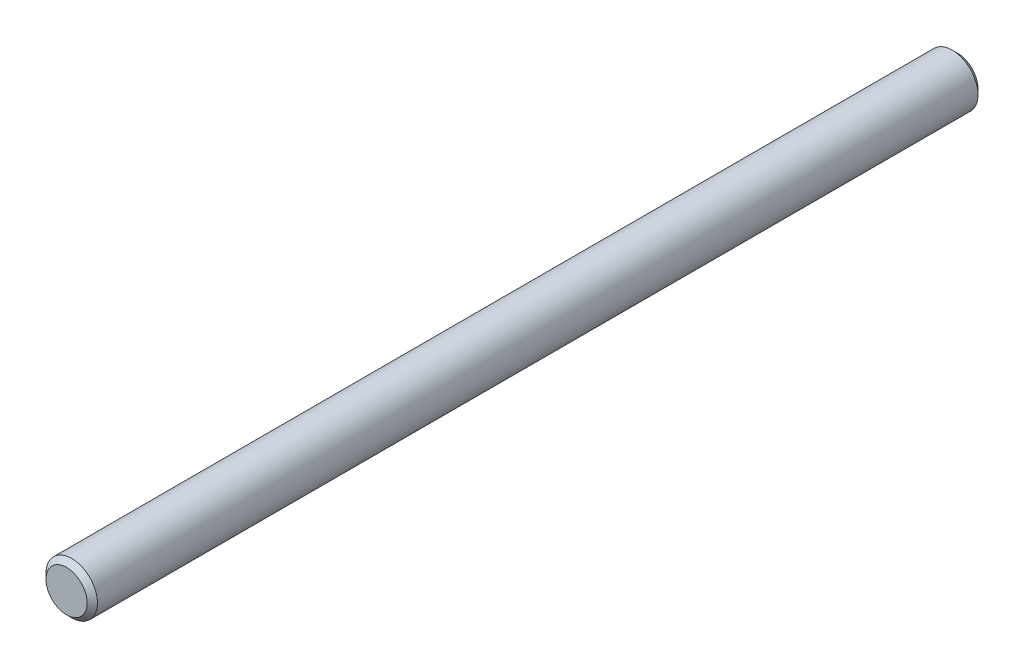
ISO-10303-21;
HEADER;
FILE_DESCRIPTION(('STEP AP214'),'2;1');
FILE_NAME('part.step','',(''),(''),'','','');
FILE_SCHEMA(('AUTOMOTIVE_DESIGN { 1 0 10303 214 1 1 1 1 }'));
ENDSEC;
DATA;
#1=APPLICATION_CONTEXT('core data for automotive mechanical design processes');
#2=APPLICATION_PROTOCOL_DEFINITION('international standard','automotive_design',2000,#1);
#3=PRODUCT_CONTEXT('',#1,'mechanical');
#4=PRODUCT('Part','Part','',(#3));
#5=PRODUCT_RELATED_PRODUCT_CATEGORY('part','',(#4));
#6=PRODUCT_DEFINITION_FORMATION('','',#4);
#7=PRODUCT_DEFINITION_CONTEXT('part definition',#1,'design');
#8=PRODUCT_DEFINITION('design','',#6,#7);
#9=PRODUCT_DEFINITION_SHAPE('','',#8);
#10=(LENGTH_UNIT() NAMED_UNIT(*) SI_UNIT(.MILLI.,.METRE.));
#11=(NAMED_UNIT(*) PLANE_ANGLE_UNIT() SI_UNIT($,.RADIAN.));
#12=(NAMED_UNIT(*) SI_UNIT($,.STERADIAN.) SOLID_ANGLE_UNIT());
#13=UNCERTAINTY_MEASURE_WITH_UNIT(LENGTH_MEASURE(1.E-05),#10,'distance_accuracy_value','');
#14=(GEOMETRIC_REPRESENTATION_CONTEXT(3) GLOBAL_UNCERTAINTY_ASSIGNED_CONTEXT((#13)) GLOBAL_UNIT_ASSIGNED_CONTEXT((#10,
#11,#12)) REPRESENTATION_CONTEXT('',''));
#15=CARTESIAN_POINT('',(0.,0.,0.));
#16=DIRECTION('',(0.,0.,1.));
#17=DIRECTION('',(1.,0.,0.));
#18=AXIS2_PLACEMENT_3D('',#15,#16,#17);
#19=CARTESIAN_POINT('',(0.,0.,110.));
#20=DIRECTION('',(0.,0.,-1.));
#21=DIRECTION('',(-1.,0.,0.));
#22=AXIS2_PLACEMENT_3D('',#19,#20,#21);
#23=CYLINDRICAL_SURFACE('',#22,6.35);
#24=CARTESIAN_POINT('',(0.,0.,-108.73));
#25=DIRECTION('',(0.,0.,1.));
#26=DIRECTION('',(1.,0.,0.));
#27=AXIS2_PLACEMENT_3D('',#24,#25,#26);
#28=CIRCLE('',#27,6.35);
#29=CARTESIAN_POINT('',(6.35,0.,-108.73));
#30=VERTEX_POINT('',#29);
#31=EDGE_CURVE('E43',#30,#30,#28,.T.);
#32=ORIENTED_EDGE('',*,*,#31,.T.);
#33=EDGE_LOOP('',(#32));
#34=FACE_BOUND('',#33,.T.);
#35=CARTESIAN_POINT('',(0.,0.,108.73));
#36=DIRECTION('',(0.,0.,1.));
#37=DIRECTION('',(1.,0.,0.));
#38=AXIS2_PLACEMENT_3D('',#35,#36,#37);
#39=CIRCLE('',#38,6.35);
#40=CARTESIAN_POINT('',(6.35,0.,108.73));
#41=VERTEX_POINT('',#40);
#42=EDGE_CURVE('E47',#41,#41,#39,.F.);
#43=ORIENTED_EDGE('',*,*,#42,.T.);
#44=EDGE_LOOP('',(#43));
#45=FACE_BOUND('',#44,.T.);
#46=ADVANCED_FACE('F32',(#34,#45),#23,.T.);
#47=CARTESIAN_POINT('',(0.,0.,110.));
#48=DIRECTION('',(0.,0.,1.));
#49=DIRECTION('',(1.,0.,0.));
#50=AXIS2_PLACEMENT_3D('',#47,#48,#49);
#51=PLANE('',#50);
#52=CARTESIAN_POINT('',(0.,0.,110.));
#53=DIRECTION('',(0.,0.,1.));
#54=DIRECTION('',(1.,0.,0.));
#55=AXIS2_PLACEMENT_3D('',#52,#53,#54);
#56=CIRCLE('',#55,5.08000000000003);
#57=CARTESIAN_POINT('',(5.08000000000003,0.,110.));
#58=VERTEX_POINT('',#57);
#59=EDGE_CURVE('E10',#58,#58,#56,.T.);
#60=ORIENTED_EDGE('',*,*,#59,.T.);
#61=EDGE_LOOP('',(#60));
#62=FACE_BOUND('',#61,.T.);
#63=ADVANCED_FACE('F63',(#62),#51,.T.);
#64=CARTESIAN_POINT('',(0.,0.,-110.));
#65=DIRECTION('',(0.,0.,1.));
#66=DIRECTION('',(1.,0.,0.));
#67=AXIS2_PLACEMENT_3D('',#64,#65,#66);
#68=PLANE('',#67);
#69=CARTESIAN_POINT('',(0.,0.,-110.));
#70=DIRECTION('',(0.,0.,1.));
#71=DIRECTION('',(1.,0.,0.));
#72=AXIS2_PLACEMENT_3D('',#69,#70,#71);
#73=CIRCLE('',#72,5.07999999999997);
#74=CARTESIAN_POINT('',(5.07999999999997,0.,-110.));
#75=VERTEX_POINT('',#74);
#76=EDGE_CURVE('E39',#75,#75,#73,.F.);
#77=ORIENTED_EDGE('',*,*,#76,.T.);
#78=EDGE_LOOP('',(#77));
#79=FACE_BOUND('',#78,.T.);
#80=ADVANCED_FACE('F60',(#79),#68,.F.);
#81=CARTESIAN_POINT('',(0.,0.,-108.73));
#82=DIRECTION('',(0.,0.,1.));
#83=DIRECTION('',(1.,0.,0.));
#84=AXIS2_PLACEMENT_3D('',#81,#82,#83);
#85=CONICAL_SURFACE('',#84,6.35,0.785398163397439);
#86=ORIENTED_EDGE('',*,*,#76,.F.);
#87=EDGE_LOOP('',(#86));
#88=FACE_BOUND('',#87,.T.);
#89=ORIENTED_EDGE('',*,*,#31,.F.);
#90=EDGE_LOOP('',(#89));
#91=FACE_BOUND('',#90,.T.);
#92=ADVANCED_FACE('F56',(#88,#91),#85,.T.);
#93=CARTESIAN_POINT('',(0.,0.,110.));
#94=DIRECTION('',(0.,0.,-1.));
#95=DIRECTION('',(-1.,0.,0.));
#96=AXIS2_PLACEMENT_3D('',#93,#94,#95);
#97=CONICAL_SURFACE('',#96,5.08000000000003,0.785398163397439);
#98=ORIENTED_EDGE('',*,*,#42,.F.);
#99=EDGE_LOOP('',(#98));
#100=FACE_BOUND('',#99,.T.);
#101=ORIENTED_EDGE('',*,*,#59,.F.);
#102=EDGE_LOOP('',(#101));
#103=FACE_BOUND('',#102,.T.);
#104=ADVANCED_FACE('F34',(#100,#103),#97,.T.);
#105=CLOSED_SHELL('',(#46,#63,#80,#92,#104));
#106=MANIFOLD_SOLID_BREP('B2',#105);
#107=ADVANCED_BREP_SHAPE_REPRESENTATION('',(#18,#106),#14);
#108=SHAPE_DEFINITION_REPRESENTATION(#9,#107);
ENDSEC;
END-ISO-10303-21;
